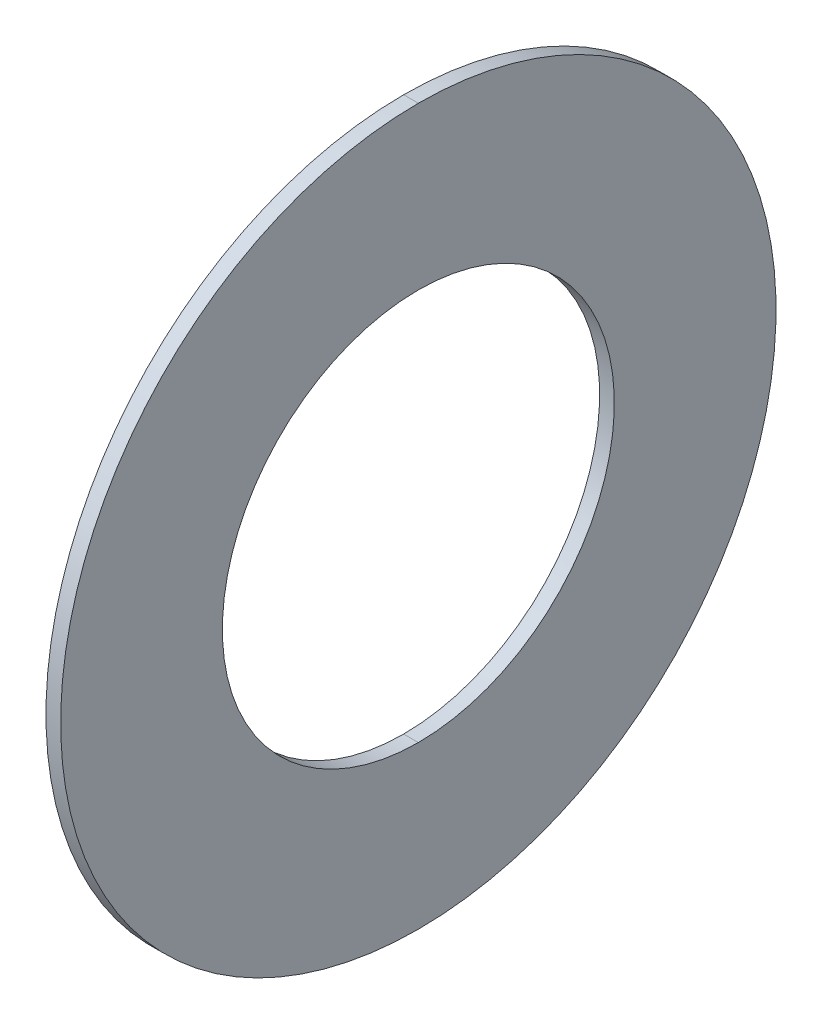
ISO-10303-21;
HEADER;
FILE_DESCRIPTION(('STEP AP214'),'2;1');
FILE_NAME('part.step','',(''),(''),'','','');
FILE_SCHEMA(('AUTOMOTIVE_DESIGN { 1 0 10303 214 1 1 1 1 }'));
ENDSEC;
DATA;
#1=APPLICATION_CONTEXT('core data for automotive mechanical design processes');
#2=APPLICATION_PROTOCOL_DEFINITION('international standard','automotive_design',2000,#1);
#3=PRODUCT_CONTEXT('',#1,'mechanical');
#4=PRODUCT('Part','Part','',(#3));
#5=PRODUCT_RELATED_PRODUCT_CATEGORY('part','',(#4));
#6=PRODUCT_DEFINITION_FORMATION('','',#4);
#7=PRODUCT_DEFINITION_CONTEXT('part definition',#1,'design');
#8=PRODUCT_DEFINITION('design','',#6,#7);
#9=PRODUCT_DEFINITION_SHAPE('','',#8);
#10=(LENGTH_UNIT() NAMED_UNIT(*) SI_UNIT(.MILLI.,.METRE.));
#11=(NAMED_UNIT(*) PLANE_ANGLE_UNIT() SI_UNIT($,.RADIAN.));
#12=(NAMED_UNIT(*) SI_UNIT($,.STERADIAN.) SOLID_ANGLE_UNIT());
#13=UNCERTAINTY_MEASURE_WITH_UNIT(LENGTH_MEASURE(1.E-05),#10,'distance_accuracy_value','');
#14=(GEOMETRIC_REPRESENTATION_CONTEXT(3) GLOBAL_UNCERTAINTY_ASSIGNED_CONTEXT((#13)) GLOBAL_UNIT_ASSIGNED_CONTEXT((#10,
#11,#12)) REPRESENTATION_CONTEXT('',''));
#15=CARTESIAN_POINT('',(0.,0.,0.));
#16=DIRECTION('',(0.,0.,1.));
#17=DIRECTION('',(1.,0.,0.));
#18=AXIS2_PLACEMENT_3D('',#15,#16,#17);
#19=CARTESIAN_POINT('',(1.07407407407407,0.,0.));
#20=DIRECTION('',(1.,0.,0.));
#21=DIRECTION('',(0.,1.,0.));
#22=AXIS2_PLACEMENT_3D('',#19,#20,#21);
#23=CYLINDRICAL_SURFACE('',#22,3.65);
#24=DIRECTION('',(1.,0.,0.));
#25=VECTOR('',#24,1.);
#26=CARTESIAN_POINT('',(1.07407407407407,-3.65,0.));
#27=LINE('',#26,#25);
#28=CARTESIAN_POINT('',(1.07407407407407,-3.65,0.));
#29=VERTEX_POINT('',#28);
#30=CARTESIAN_POINT('',(1.22407407407408,-3.65,0.));
#31=VERTEX_POINT('',#30);
#32=EDGE_CURVE('E71',#29,#31,#27,.T.);
#33=ORIENTED_EDGE('',*,*,#32,.F.);
#34=CARTESIAN_POINT('',(1.07407407407407,0.,0.));
#35=DIRECTION('',(1.,0.,0.));
#36=DIRECTION('',(0.,1.,0.));
#37=AXIS2_PLACEMENT_3D('',#34,#35,#36);
#38=CIRCLE('',#37,3.65);
#39=CARTESIAN_POINT('',(1.07407407407407,3.65,0.));
#40=VERTEX_POINT('',#39);
#41=EDGE_CURVE('E11',#29,#40,#38,.T.);
#42=ORIENTED_EDGE('',*,*,#41,.T.);
#43=DIRECTION('',(1.,0.,0.));
#44=VECTOR('',#43,1.);
#45=CARTESIAN_POINT('',(1.07407407407407,3.65,0.));
#46=LINE('',#45,#44);
#47=CARTESIAN_POINT('',(1.22407407407408,3.65,0.));
#48=VERTEX_POINT('',#47);
#49=EDGE_CURVE('E68',#40,#48,#46,.T.);
#50=ORIENTED_EDGE('',*,*,#49,.T.);
#51=CARTESIAN_POINT('',(1.22407407407408,0.,0.));
#52=DIRECTION('',(1.,0.,0.));
#53=DIRECTION('',(0.,1.,0.));
#54=AXIS2_PLACEMENT_3D('',#51,#52,#53);
#55=CIRCLE('',#54,3.65);
#56=EDGE_CURVE('E92',#31,#48,#55,.T.);
#57=ORIENTED_EDGE('',*,*,#56,.F.);
#58=EDGE_LOOP('',(#33,#42,#50,#57));
#59=FACE_BOUND('',#58,.T.);
#60=ADVANCED_FACE('F17',(#59),#23,.T.);
#61=CARTESIAN_POINT('',(1.07407407407407,0.,0.));
#62=DIRECTION('',(-1.,0.,0.));
#63=DIRECTION('',(0.,0.,1.));
#64=AXIS2_PLACEMENT_3D('',#61,#62,#63);
#65=PLANE('',#64);
#66=CARTESIAN_POINT('',(1.07407407407407,0.,0.));
#67=DIRECTION('',(1.,0.,0.));
#68=DIRECTION('',(0.,1.,0.));
#69=AXIS2_PLACEMENT_3D('',#66,#67,#68);
#70=CIRCLE('',#69,2.);
#71=CARTESIAN_POINT('',(1.07407407407407,2.,0.));
#72=VERTEX_POINT('',#71);
#73=CARTESIAN_POINT('',(1.07407407407407,-2.,0.));
#74=VERTEX_POINT('',#73);
#75=EDGE_CURVE('E27',#72,#74,#70,.T.);
#76=ORIENTED_EDGE('',*,*,#75,.T.);
#77=CARTESIAN_POINT('',(1.07407407407407,0.,0.));
#78=DIRECTION('',(1.,0.,0.));
#79=DIRECTION('',(0.,1.,0.));
#80=AXIS2_PLACEMENT_3D('',#77,#78,#79);
#81=CIRCLE('',#80,2.);
#82=EDGE_CURVE('E81',#74,#72,#81,.T.);
#83=ORIENTED_EDGE('',*,*,#82,.T.);
#84=EDGE_LOOP('',(#76,#83));
#85=FACE_BOUND('',#84,.T.);
#86=CARTESIAN_POINT('',(1.07407407407407,0.,0.));
#87=DIRECTION('',(1.,0.,0.));
#88=DIRECTION('',(0.,1.,0.));
#89=AXIS2_PLACEMENT_3D('',#86,#87,#88);
#90=CIRCLE('',#89,3.65);
#91=EDGE_CURVE('E77',#40,#29,#90,.T.);
#92=ORIENTED_EDGE('',*,*,#91,.F.);
#93=ORIENTED_EDGE('',*,*,#41,.F.);
#94=EDGE_LOOP('',(#92,#93));
#95=FACE_BOUND('',#94,.T.);
#96=ADVANCED_FACE('F19',(#85,#95),#65,.T.);
#97=CARTESIAN_POINT('',(1.22407407407408,0.,0.));
#98=DIRECTION('',(1.,0.,0.));
#99=DIRECTION('',(0.,1.,0.));
#100=AXIS2_PLACEMENT_3D('',#97,#98,#99);
#101=CYLINDRICAL_SURFACE('',#100,2.);
#102=DIRECTION('',(1.,0.,0.));
#103=VECTOR('',#102,1.);
#104=CARTESIAN_POINT('',(1.22407407407408,-2.,0.));
#105=LINE('',#104,#103);
#106=CARTESIAN_POINT('',(1.22407407407408,-2.,0.));
#107=VERTEX_POINT('',#106);
#108=EDGE_CURVE('E100',#74,#107,#105,.T.);
#109=ORIENTED_EDGE('',*,*,#108,.F.);
#110=ORIENTED_EDGE('',*,*,#75,.F.);
#111=DIRECTION('',(1.,0.,0.));
#112=VECTOR('',#111,1.);
#113=CARTESIAN_POINT('',(1.22407407407408,2.,0.));
#114=LINE('',#113,#112);
#115=CARTESIAN_POINT('',(1.22407407407408,2.,0.));
#116=VERTEX_POINT('',#115);
#117=EDGE_CURVE('E94',#72,#116,#114,.T.);
#118=ORIENTED_EDGE('',*,*,#117,.T.);
#119=CARTESIAN_POINT('',(1.22407407407408,0.,0.));
#120=DIRECTION('',(1.,0.,0.));
#121=DIRECTION('',(0.,1.,0.));
#122=AXIS2_PLACEMENT_3D('',#119,#120,#121);
#123=CIRCLE('',#122,2.);
#124=EDGE_CURVE('E39',#116,#107,#123,.T.);
#125=ORIENTED_EDGE('',*,*,#124,.T.);
#126=EDGE_LOOP('',(#109,#110,#118,#125));
#127=FACE_BOUND('',#126,.T.);
#128=ADVANCED_FACE('F176',(#127),#101,.F.);
#129=CARTESIAN_POINT('',(1.22407407407408,0.,0.));
#130=DIRECTION('',(1.,0.,0.));
#131=DIRECTION('',(0.,1.,0.));
#132=AXIS2_PLACEMENT_3D('',#129,#130,#131);
#133=PLANE('',#132);
#134=ORIENTED_EDGE('',*,*,#124,.F.);
#135=CARTESIAN_POINT('',(1.22407407407408,0.,0.));
#136=DIRECTION('',(1.,0.,0.));
#137=DIRECTION('',(0.,1.,0.));
#138=AXIS2_PLACEMENT_3D('',#135,#136,#137);
#139=CIRCLE('',#138,2.);
#140=EDGE_CURVE('E96',#107,#116,#139,.T.);
#141=ORIENTED_EDGE('',*,*,#140,.F.);
#142=EDGE_LOOP('',(#134,#141));
#143=FACE_BOUND('',#142,.T.);
#144=CARTESIAN_POINT('',(1.22407407407408,0.,0.));
#145=DIRECTION('',(1.,0.,0.));
#146=DIRECTION('',(0.,1.,0.));
#147=AXIS2_PLACEMENT_3D('',#144,#145,#146);
#148=CIRCLE('',#147,3.65);
#149=EDGE_CURVE('E79',#48,#31,#148,.T.);
#150=ORIENTED_EDGE('',*,*,#149,.T.);
#151=ORIENTED_EDGE('',*,*,#56,.T.);
#152=EDGE_LOOP('',(#150,#151));
#153=FACE_BOUND('',#152,.T.);
#154=ADVANCED_FACE('F122',(#143,#153),#133,.T.);
#155=CARTESIAN_POINT('',(1.22407407407408,0.,0.));
#156=DIRECTION('',(1.,0.,0.));
#157=DIRECTION('',(0.,1.,0.));
#158=AXIS2_PLACEMENT_3D('',#155,#156,#157);
#159=CYLINDRICAL_SURFACE('',#158,2.);
#160=ORIENTED_EDGE('',*,*,#82,.F.);
#161=ORIENTED_EDGE('',*,*,#108,.T.);
#162=ORIENTED_EDGE('',*,*,#140,.T.);
#163=ORIENTED_EDGE('',*,*,#117,.F.);
#164=EDGE_LOOP('',(#160,#161,#162,#163));
#165=FACE_BOUND('',#164,.T.);
#166=ADVANCED_FACE('F175',(#165),#159,.F.);
#167=CARTESIAN_POINT('',(1.07407407407407,0.,0.));
#168=DIRECTION('',(1.,0.,0.));
#169=DIRECTION('',(0.,1.,0.));
#170=AXIS2_PLACEMENT_3D('',#167,#168,#169);
#171=CYLINDRICAL_SURFACE('',#170,3.65);
#172=ORIENTED_EDGE('',*,*,#91,.T.);
#173=ORIENTED_EDGE('',*,*,#32,.T.);
#174=ORIENTED_EDGE('',*,*,#149,.F.);
#175=ORIENTED_EDGE('',*,*,#49,.F.);
#176=EDGE_LOOP('',(#172,#173,#174,#175));
#177=FACE_BOUND('',#176,.T.);
#178=ADVANCED_FACE('F76',(#177),#171,.T.);
#179=CLOSED_SHELL('',(#60,#96,#128,#154,#166,#178));
#180=MANIFOLD_SOLID_BREP('B1',#179);
#181=ADVANCED_BREP_SHAPE_REPRESENTATION('',(#18,#180),#14);
#182=SHAPE_DEFINITION_REPRESENTATION(#9,#181);
ENDSEC;
END-ISO-10303-21;
